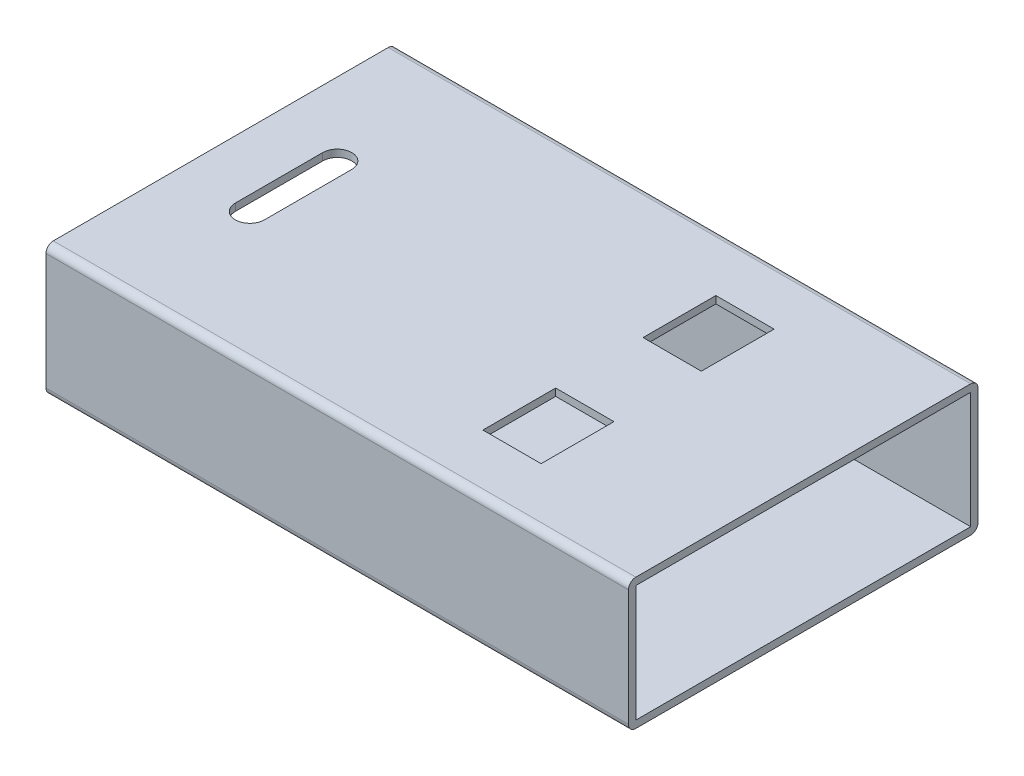
ISO-10303-21;
HEADER;
FILE_DESCRIPTION(('STEP AP214'),'2;1');
FILE_NAME('part.step','',(''),(''),'','','');
FILE_SCHEMA(('AUTOMOTIVE_DESIGN { 1 0 10303 214 1 1 1 1 }'));
ENDSEC;
DATA;
#1=APPLICATION_CONTEXT('core data for automotive mechanical design processes');
#2=APPLICATION_PROTOCOL_DEFINITION('international standard','automotive_design',2000,#1);
#3=PRODUCT_CONTEXT('',#1,'mechanical');
#4=PRODUCT('Part','Part','',(#3));
#5=PRODUCT_RELATED_PRODUCT_CATEGORY('part','',(#4));
#6=PRODUCT_DEFINITION_FORMATION('','',#4);
#7=PRODUCT_DEFINITION_CONTEXT('part definition',#1,'design');
#8=PRODUCT_DEFINITION('design','',#6,#7);
#9=PRODUCT_DEFINITION_SHAPE('','',#8);
#10=(LENGTH_UNIT() NAMED_UNIT(*) SI_UNIT(.MILLI.,.METRE.));
#11=(NAMED_UNIT(*) PLANE_ANGLE_UNIT() SI_UNIT($,.RADIAN.));
#12=(NAMED_UNIT(*) SI_UNIT($,.STERADIAN.) SOLID_ANGLE_UNIT());
#13=UNCERTAINTY_MEASURE_WITH_UNIT(LENGTH_MEASURE(1.E-05),#10,'distance_accuracy_value','');
#14=(GEOMETRIC_REPRESENTATION_CONTEXT(3) GLOBAL_UNCERTAINTY_ASSIGNED_CONTEXT((#13)) GLOBAL_UNIT_ASSIGNED_CONTEXT((#10,
#11,#12)) REPRESENTATION_CONTEXT('',''));
#15=CARTESIAN_POINT('',(0.,0.,0.));
#16=DIRECTION('',(0.,0.,1.));
#17=DIRECTION('',(1.,0.,0.));
#18=AXIS2_PLACEMENT_3D('',#15,#16,#17);
#19=CARTESIAN_POINT('',(-20.,2.,-5.75));
#20=DIRECTION('',(1.,0.,0.));
#21=DIRECTION('',(0.,0.,-1.));
#22=AXIS2_PLACEMENT_3D('',#19,#20,#21);
#23=CYLINDRICAL_SURFACE('',#22,0.25);
#24=CARTESIAN_POINT('',(0.,2.,-5.75));
#25=DIRECTION('',(1.,0.,0.));
#26=DIRECTION('',(0.,0.,1.));
#27=AXIS2_PLACEMENT_3D('',#24,#25,#26);
#28=CIRCLE('',#27,0.25);
#29=CARTESIAN_POINT('',(0.,2.,-6.));
#30=VERTEX_POINT('',#29);
#31=CARTESIAN_POINT('',(0.,2.25,-5.75));
#32=VERTEX_POINT('',#31);
#33=EDGE_CURVE('E489',#30,#32,#28,.T.);
#34=ORIENTED_EDGE('',*,*,#33,.F.);
#35=DIRECTION('',(1.,0.,0.));
#36=VECTOR('',#35,1.);
#37=CARTESIAN_POINT('',(-20.,2.,-6.));
#38=LINE('',#37,#36);
#39=CARTESIAN_POINT('',(-20.,2.,-6.));
#40=VERTEX_POINT('',#39);
#41=EDGE_CURVE('E544',#40,#30,#38,.T.);
#42=ORIENTED_EDGE('',*,*,#41,.F.);
#43=CARTESIAN_POINT('',(-20.,2.,-5.75));
#44=DIRECTION('',(1.,0.,0.));
#45=DIRECTION('',(0.,0.,1.));
#46=AXIS2_PLACEMENT_3D('',#43,#44,#45);
#47=CIRCLE('',#46,0.25);
#48=CARTESIAN_POINT('',(-20.,2.25,-5.75));
#49=VERTEX_POINT('',#48);
#50=EDGE_CURVE('E496',#40,#49,#47,.T.);
#51=ORIENTED_EDGE('',*,*,#50,.T.);
#52=DIRECTION('',(1.,0.,0.));
#53=VECTOR('',#52,1.);
#54=CARTESIAN_POINT('',(-20.,2.25,-5.75));
#55=LINE('',#54,#53);
#56=EDGE_CURVE('E521',#49,#32,#55,.T.);
#57=ORIENTED_EDGE('',*,*,#56,.T.);
#58=EDGE_LOOP('',(#34,#42,#51,#57));
#59=FACE_BOUND('',#58,.T.);
#60=ADVANCED_FACE('F74',(#59),#23,.T.);
#61=CARTESIAN_POINT('',(-20.,-2.,-6.));
#62=DIRECTION('',(0.,0.,-1.));
#63=DIRECTION('',(-1.,0.,0.));
#64=AXIS2_PLACEMENT_3D('',#61,#62,#63);
#65=PLANE('',#64);
#66=DIRECTION('',(0.,1.,0.));
#67=VECTOR('',#66,1.);
#68=CARTESIAN_POINT('',(0.,-2.,-6.));
#69=LINE('',#68,#67);
#70=CARTESIAN_POINT('',(0.,-2.,-6.));
#71=VERTEX_POINT('',#70);
#72=EDGE_CURVE('E500',#71,#30,#69,.T.);
#73=ORIENTED_EDGE('',*,*,#72,.F.);
#74=DIRECTION('',(1.,0.,0.));
#75=VECTOR('',#74,1.);
#76=CARTESIAN_POINT('',(-20.,-2.,-6.));
#77=LINE('',#76,#75);
#78=CARTESIAN_POINT('',(-20.,-2.,-6.));
#79=VERTEX_POINT('',#78);
#80=EDGE_CURVE('E547',#79,#71,#77,.T.);
#81=ORIENTED_EDGE('',*,*,#80,.F.);
#82=DIRECTION('',(0.,1.,0.));
#83=VECTOR('',#82,1.);
#84=CARTESIAN_POINT('',(-20.,-2.,-6.));
#85=LINE('',#84,#83);
#86=EDGE_CURVE('E518',#79,#40,#85,.T.);
#87=ORIENTED_EDGE('',*,*,#86,.T.);
#88=ORIENTED_EDGE('',*,*,#41,.T.);
#89=EDGE_LOOP('',(#73,#81,#87,#88));
#90=FACE_BOUND('',#89,.T.);
#91=ADVANCED_FACE('F619',(#90),#65,.T.);
#92=CARTESIAN_POINT('',(-20.,-2.,-5.75));
#93=DIRECTION('',(1.,0.,0.));
#94=DIRECTION('',(0.,0.,-1.));
#95=AXIS2_PLACEMENT_3D('',#92,#93,#94);
#96=CYLINDRICAL_SURFACE('',#95,0.25);
#97=CARTESIAN_POINT('',(0.,-2.,-5.75));
#98=DIRECTION('',(1.,0.,0.));
#99=DIRECTION('',(0.,0.,-1.));
#100=AXIS2_PLACEMENT_3D('',#97,#98,#99);
#101=CIRCLE('',#100,0.25);
#102=CARTESIAN_POINT('',(0.,-2.25,-5.75));
#103=VERTEX_POINT('',#102);
#104=EDGE_CURVE('E539',#103,#71,#101,.T.);
#105=ORIENTED_EDGE('',*,*,#104,.F.);
#106=DIRECTION('',(1.,0.,0.));
#107=VECTOR('',#106,1.);
#108=CARTESIAN_POINT('',(-20.,-2.25,-5.75));
#109=LINE('',#108,#107);
#110=CARTESIAN_POINT('',(-20.,-2.25,-5.75));
#111=VERTEX_POINT('',#110);
#112=EDGE_CURVE('E549',#111,#103,#109,.T.);
#113=ORIENTED_EDGE('',*,*,#112,.F.);
#114=CARTESIAN_POINT('',(-20.,-2.,-5.75));
#115=DIRECTION('',(1.,0.,0.));
#116=DIRECTION('',(0.,0.,-1.));
#117=AXIS2_PLACEMENT_3D('',#114,#115,#116);
#118=CIRCLE('',#117,0.25);
#119=EDGE_CURVE('E515',#111,#79,#118,.T.);
#120=ORIENTED_EDGE('',*,*,#119,.T.);
#121=ORIENTED_EDGE('',*,*,#80,.T.);
#122=EDGE_LOOP('',(#105,#113,#120,#121));
#123=FACE_BOUND('',#122,.T.);
#124=ADVANCED_FACE('F624',(#123),#96,.T.);
#125=CARTESIAN_POINT('',(-20.,-2.25,5.75));
#126=DIRECTION('',(0.,-1.,0.));
#127=DIRECTION('',(0.,0.,-1.));
#128=AXIS2_PLACEMENT_3D('',#125,#126,#127);
#129=PLANE('',#128);
#130=CARTESIAN_POINT('',(-17.5,-2.25,1.5));
#131=DIRECTION('',(0.,1.,0.));
#132=DIRECTION('',(0.,0.,1.));
#133=AXIS2_PLACEMENT_3D('',#130,#131,#132);
#134=CIRCLE('',#133,0.5);
#135=CARTESIAN_POINT('',(-18.,-2.25,1.5));
#136=VERTEX_POINT('',#135);
#137=CARTESIAN_POINT('',(-17.,-2.25,1.5));
#138=VERTEX_POINT('',#137);
#139=EDGE_CURVE('E313',#136,#138,#134,.T.);
#140=ORIENTED_EDGE('',*,*,#139,.T.);
#141=DIRECTION('',(0.,0.,-1.));
#142=VECTOR('',#141,1.);
#143=CARTESIAN_POINT('',(-17.,-2.25,1.5));
#144=LINE('',#143,#142);
#145=CARTESIAN_POINT('',(-17.,-2.25,-1.5));
#146=VERTEX_POINT('',#145);
#147=EDGE_CURVE('E323',#138,#146,#144,.T.);
#148=ORIENTED_EDGE('',*,*,#147,.T.);
#149=CARTESIAN_POINT('',(-17.5,-2.25,-1.5));
#150=DIRECTION('',(0.,1.,0.));
#151=DIRECTION('',(0.,0.,1.));
#152=AXIS2_PLACEMENT_3D('',#149,#150,#151);
#153=CIRCLE('',#152,0.5);
#154=CARTESIAN_POINT('',(-18.,-2.25,-1.5));
#155=VERTEX_POINT('',#154);
#156=EDGE_CURVE('E88',#146,#155,#153,.T.);
#157=ORIENTED_EDGE('',*,*,#156,.T.);
#158=DIRECTION('',(0.,0.,1.));
#159=VECTOR('',#158,1.);
#160=CARTESIAN_POINT('',(-18.,-2.25,1.5));
#161=LINE('',#160,#159);
#162=EDGE_CURVE('E331',#155,#136,#161,.T.);
#163=ORIENTED_EDGE('',*,*,#162,.T.);
#164=EDGE_LOOP('',(#140,#148,#157,#163));
#165=FACE_BOUND('',#164,.T.);
#166=DIRECTION('',(1.,0.,0.));
#167=VECTOR('',#166,1.);
#168=CARTESIAN_POINT('',(-7.,-2.25,-1.5));
#169=LINE('',#168,#167);
#170=CARTESIAN_POINT('',(-7.,-2.25,-1.5));
#171=VERTEX_POINT('',#170);
#172=CARTESIAN_POINT('',(-5.,-2.25,-1.5));
#173=VERTEX_POINT('',#172);
#174=EDGE_CURVE('E364',#171,#173,#169,.T.);
#175=ORIENTED_EDGE('',*,*,#174,.T.);
#176=DIRECTION('',(0.,0.,-1.));
#177=VECTOR('',#176,1.);
#178=CARTESIAN_POINT('',(-5.,-2.25,-1.5));
#179=LINE('',#178,#177);
#180=CARTESIAN_POINT('',(-5.,-2.25,-4.));
#181=VERTEX_POINT('',#180);
#182=EDGE_CURVE('E367',#173,#181,#179,.T.);
#183=ORIENTED_EDGE('',*,*,#182,.T.);
#184=DIRECTION('',(-1.,0.,0.));
#185=VECTOR('',#184,1.);
#186=CARTESIAN_POINT('',(-7.,-2.25,-4.));
#187=LINE('',#186,#185);
#188=CARTESIAN_POINT('',(-7.,-2.25,-4.));
#189=VERTEX_POINT('',#188);
#190=EDGE_CURVE('E371',#181,#189,#187,.T.);
#191=ORIENTED_EDGE('',*,*,#190,.T.);
#192=DIRECTION('',(0.,0.,1.));
#193=VECTOR('',#192,1.);
#194=CARTESIAN_POINT('',(-7.,-2.25,-1.5));
#195=LINE('',#194,#193);
#196=EDGE_CURVE('E374',#189,#171,#195,.T.);
#197=ORIENTED_EDGE('',*,*,#196,.T.);
#198=EDGE_LOOP('',(#175,#183,#191,#197));
#199=FACE_BOUND('',#198,.T.);
#200=DIRECTION('',(0.,0.,-1.));
#201=VECTOR('',#200,1.);
#202=CARTESIAN_POINT('',(-5.,-2.25,1.5));
#203=LINE('',#202,#201);
#204=CARTESIAN_POINT('',(-5.,-2.25,4.));
#205=VERTEX_POINT('',#204);
#206=CARTESIAN_POINT('',(-5.,-2.25,1.5));
#207=VERTEX_POINT('',#206);
#208=EDGE_CURVE('E414',#205,#207,#203,.T.);
#209=ORIENTED_EDGE('',*,*,#208,.T.);
#210=DIRECTION('',(-1.,0.,0.));
#211=VECTOR('',#210,1.);
#212=CARTESIAN_POINT('',(-7.,-2.25,1.5));
#213=LINE('',#212,#211);
#214=CARTESIAN_POINT('',(-7.,-2.25,1.5));
#215=VERTEX_POINT('',#214);
#216=EDGE_CURVE('E417',#207,#215,#213,.T.);
#217=ORIENTED_EDGE('',*,*,#216,.T.);
#218=DIRECTION('',(0.,0.,1.));
#219=VECTOR('',#218,1.);
#220=CARTESIAN_POINT('',(-7.,-2.25,1.5));
#221=LINE('',#220,#219);
#222=CARTESIAN_POINT('',(-7.,-2.25,4.));
#223=VERTEX_POINT('',#222);
#224=EDGE_CURVE('E421',#215,#223,#221,.T.);
#225=ORIENTED_EDGE('',*,*,#224,.T.);
#226=DIRECTION('',(1.,0.,0.));
#227=VECTOR('',#226,1.);
#228=CARTESIAN_POINT('',(-7.,-2.25,4.));
#229=LINE('',#228,#227);
#230=EDGE_CURVE('E424',#223,#205,#229,.T.);
#231=ORIENTED_EDGE('',*,*,#230,.T.);
#232=EDGE_LOOP('',(#209,#217,#225,#231));
#233=FACE_BOUND('',#232,.T.);
#234=DIRECTION('',(0.,0.,-1.));
#235=VECTOR('',#234,1.);
#236=CARTESIAN_POINT('',(0.,-2.25,5.75));
#237=LINE('',#236,#235);
#238=CARTESIAN_POINT('',(0.,-2.25,5.75));
#239=VERTEX_POINT('',#238);
#240=EDGE_CURVE('E536',#239,#103,#237,.T.);
#241=ORIENTED_EDGE('',*,*,#240,.F.);
#242=DIRECTION('',(1.,0.,0.));
#243=VECTOR('',#242,1.);
#244=CARTESIAN_POINT('',(-20.,-2.25,5.75));
#245=LINE('',#244,#243);
#246=CARTESIAN_POINT('',(-20.,-2.25,5.75));
#247=VERTEX_POINT('',#246);
#248=EDGE_CURVE('E551',#247,#239,#245,.T.);
#249=ORIENTED_EDGE('',*,*,#248,.F.);
#250=DIRECTION('',(0.,0.,-1.));
#251=VECTOR('',#250,1.);
#252=CARTESIAN_POINT('',(-20.,-2.25,5.75));
#253=LINE('',#252,#251);
#254=EDGE_CURVE('E512',#247,#111,#253,.T.);
#255=ORIENTED_EDGE('',*,*,#254,.T.);
#256=ORIENTED_EDGE('',*,*,#112,.T.);
#257=EDGE_LOOP('',(#241,#249,#255,#256));
#258=FACE_BOUND('',#257,.T.);
#259=ADVANCED_FACE('F328',(#165,#199,#233,#258),#129,.T.);
#260=CARTESIAN_POINT('',(-20.,-2.,5.75));
#261=DIRECTION('',(1.,0.,0.));
#262=DIRECTION('',(0.,0.,-1.));
#263=AXIS2_PLACEMENT_3D('',#260,#261,#262);
#264=CYLINDRICAL_SURFACE('',#263,0.25);
#265=CARTESIAN_POINT('',(0.,-2.,5.75));
#266=DIRECTION('',(1.,0.,0.));
#267=DIRECTION('',(0.,0.,1.));
#268=AXIS2_PLACEMENT_3D('',#265,#266,#267);
#269=CIRCLE('',#268,0.25);
#270=CARTESIAN_POINT('',(0.,-2.,6.));
#271=VERTEX_POINT('',#270);
#272=EDGE_CURVE('E533',#271,#239,#269,.T.);
#273=ORIENTED_EDGE('',*,*,#272,.F.);
#274=DIRECTION('',(1.,0.,0.));
#275=VECTOR('',#274,1.);
#276=CARTESIAN_POINT('',(-20.,-2.,6.));
#277=LINE('',#276,#275);
#278=CARTESIAN_POINT('',(-20.,-2.,6.));
#279=VERTEX_POINT('',#278);
#280=EDGE_CURVE('E553',#279,#271,#277,.T.);
#281=ORIENTED_EDGE('',*,*,#280,.F.);
#282=CARTESIAN_POINT('',(-20.,-2.,5.75));
#283=DIRECTION('',(1.,0.,0.));
#284=DIRECTION('',(0.,0.,1.));
#285=AXIS2_PLACEMENT_3D('',#282,#283,#284);
#286=CIRCLE('',#285,0.25);
#287=EDGE_CURVE('E509',#279,#247,#286,.T.);
#288=ORIENTED_EDGE('',*,*,#287,.T.);
#289=ORIENTED_EDGE('',*,*,#248,.T.);
#290=EDGE_LOOP('',(#273,#281,#288,#289));
#291=FACE_BOUND('',#290,.T.);
#292=ADVANCED_FACE('F652',(#291),#264,.T.);
#293=CARTESIAN_POINT('',(-20.,-2.,6.));
#294=DIRECTION('',(0.,0.,1.));
#295=DIRECTION('',(1.,0.,0.));
#296=AXIS2_PLACEMENT_3D('',#293,#294,#295);
#297=PLANE('',#296);
#298=DIRECTION('',(0.,-1.,0.));
#299=VECTOR('',#298,1.);
#300=CARTESIAN_POINT('',(0.,-2.,6.));
#301=LINE('',#300,#299);
#302=CARTESIAN_POINT('',(0.,2.,6.));
#303=VERTEX_POINT('',#302);
#304=EDGE_CURVE('E530',#303,#271,#301,.T.);
#305=ORIENTED_EDGE('',*,*,#304,.F.);
#306=DIRECTION('',(1.,0.,0.));
#307=VECTOR('',#306,1.);
#308=CARTESIAN_POINT('',(-20.,2.,6.));
#309=LINE('',#308,#307);
#310=CARTESIAN_POINT('',(-20.,2.,6.));
#311=VERTEX_POINT('',#310);
#312=EDGE_CURVE('E555',#311,#303,#309,.T.);
#313=ORIENTED_EDGE('',*,*,#312,.F.);
#314=DIRECTION('',(0.,-1.,0.));
#315=VECTOR('',#314,1.);
#316=CARTESIAN_POINT('',(-20.,-2.,6.));
#317=LINE('',#316,#315);
#318=EDGE_CURVE('E506',#311,#279,#317,.T.);
#319=ORIENTED_EDGE('',*,*,#318,.T.);
#320=ORIENTED_EDGE('',*,*,#280,.T.);
#321=EDGE_LOOP('',(#305,#313,#319,#320));
#322=FACE_BOUND('',#321,.T.);
#323=ADVANCED_FACE('F648',(#322),#297,.T.);
#324=CARTESIAN_POINT('',(-20.,2.,5.75));
#325=DIRECTION('',(1.,0.,0.));
#326=DIRECTION('',(0.,0.,-1.));
#327=AXIS2_PLACEMENT_3D('',#324,#325,#326);
#328=CYLINDRICAL_SURFACE('',#327,0.25);
#329=CARTESIAN_POINT('',(0.,2.,5.75));
#330=DIRECTION('',(1.,0.,0.));
#331=DIRECTION('',(0.,0.,1.));
#332=AXIS2_PLACEMENT_3D('',#329,#330,#331);
#333=CIRCLE('',#332,0.25);
#334=CARTESIAN_POINT('',(0.,2.25,5.75));
#335=VERTEX_POINT('',#334);
#336=EDGE_CURVE('E527',#335,#303,#333,.T.);
#337=ORIENTED_EDGE('',*,*,#336,.F.);
#338=DIRECTION('',(1.,0.,0.));
#339=VECTOR('',#338,1.);
#340=CARTESIAN_POINT('',(-20.,2.25,5.75));
#341=LINE('',#340,#339);
#342=CARTESIAN_POINT('',(-20.,2.25,5.75));
#343=VERTEX_POINT('',#342);
#344=EDGE_CURVE('E557',#343,#335,#341,.T.);
#345=ORIENTED_EDGE('',*,*,#344,.F.);
#346=CARTESIAN_POINT('',(-20.,2.,5.75));
#347=DIRECTION('',(1.,0.,0.));
#348=DIRECTION('',(0.,0.,1.));
#349=AXIS2_PLACEMENT_3D('',#346,#347,#348);
#350=CIRCLE('',#349,0.25);
#351=EDGE_CURVE('E503',#343,#311,#350,.T.);
#352=ORIENTED_EDGE('',*,*,#351,.T.);
#353=ORIENTED_EDGE('',*,*,#312,.T.);
#354=EDGE_LOOP('',(#337,#345,#352,#353));
#355=FACE_BOUND('',#354,.T.);
#356=ADVANCED_FACE('F646',(#355),#328,.T.);
#357=CARTESIAN_POINT('',(-20.,2.25,5.75));
#358=DIRECTION('',(0.,1.,0.));
#359=DIRECTION('',(0.,0.,1.));
#360=AXIS2_PLACEMENT_3D('',#357,#358,#359);
#361=PLANE('',#360);
#362=CARTESIAN_POINT('',(-17.5,2.25,1.5));
#363=DIRECTION('',(0.,1.,0.));
#364=DIRECTION('',(0.,0.,1.));
#365=AXIS2_PLACEMENT_3D('',#362,#363,#364);
#366=CIRCLE('',#365,0.5);
#367=CARTESIAN_POINT('',(-18.,2.25,1.5));
#368=VERTEX_POINT('',#367);
#369=CARTESIAN_POINT('',(-17.,2.25,1.5));
#370=VERTEX_POINT('',#369);
#371=EDGE_CURVE('E96',#368,#370,#366,.T.);
#372=ORIENTED_EDGE('',*,*,#371,.F.);
#373=DIRECTION('',(0.,0.,1.));
#374=VECTOR('',#373,1.);
#375=CARTESIAN_POINT('',(-18.,2.25,1.5));
#376=LINE('',#375,#374);
#377=CARTESIAN_POINT('',(-18.,2.25,-1.5));
#378=VERTEX_POINT('',#377);
#379=EDGE_CURVE('E332',#378,#368,#376,.T.);
#380=ORIENTED_EDGE('',*,*,#379,.F.);
#381=CARTESIAN_POINT('',(-17.5,2.25,-1.5));
#382=DIRECTION('',(0.,1.,0.));
#383=DIRECTION('',(0.,0.,1.));
#384=AXIS2_PLACEMENT_3D('',#381,#382,#383);
#385=CIRCLE('',#384,0.5);
#386=CARTESIAN_POINT('',(-17.,2.25,-1.5));
#387=VERTEX_POINT('',#386);
#388=EDGE_CURVE('E335',#387,#378,#385,.T.);
#389=ORIENTED_EDGE('',*,*,#388,.F.);
#390=DIRECTION('',(0.,0.,-1.));
#391=VECTOR('',#390,1.);
#392=CARTESIAN_POINT('',(-17.,2.25,1.5));
#393=LINE('',#392,#391);
#394=EDGE_CURVE('E341',#370,#387,#393,.T.);
#395=ORIENTED_EDGE('',*,*,#394,.F.);
#396=EDGE_LOOP('',(#372,#380,#389,#395));
#397=FACE_BOUND('',#396,.T.);
#398=DIRECTION('',(1.,0.,0.));
#399=VECTOR('',#398,1.);
#400=CARTESIAN_POINT('',(-7.,2.25,-1.5));
#401=LINE('',#400,#399);
#402=CARTESIAN_POINT('',(-7.,2.25,-1.5));
#403=VERTEX_POINT('',#402);
#404=CARTESIAN_POINT('',(-5.,2.25,-1.5));
#405=VERTEX_POINT('',#404);
#406=EDGE_CURVE('E363',#403,#405,#401,.T.);
#407=ORIENTED_EDGE('',*,*,#406,.F.);
#408=DIRECTION('',(0.,0.,1.));
#409=VECTOR('',#408,1.);
#410=CARTESIAN_POINT('',(-7.,2.25,-1.5));
#411=LINE('',#410,#409);
#412=CARTESIAN_POINT('',(-7.,2.25,-4.));
#413=VERTEX_POINT('',#412);
#414=EDGE_CURVE('E368',#413,#403,#411,.T.);
#415=ORIENTED_EDGE('',*,*,#414,.F.);
#416=DIRECTION('',(-1.,0.,0.));
#417=VECTOR('',#416,1.);
#418=CARTESIAN_POINT('',(-7.,2.25,-4.));
#419=LINE('',#418,#417);
#420=CARTESIAN_POINT('',(-5.,2.25,-4.));
#421=VERTEX_POINT('',#420);
#422=EDGE_CURVE('E382',#421,#413,#419,.T.);
#423=ORIENTED_EDGE('',*,*,#422,.F.);
#424=DIRECTION('',(0.,0.,-1.));
#425=VECTOR('',#424,1.);
#426=CARTESIAN_POINT('',(-5.,2.25,-1.5));
#427=LINE('',#426,#425);
#428=EDGE_CURVE('E379',#405,#421,#427,.T.);
#429=ORIENTED_EDGE('',*,*,#428,.F.);
#430=EDGE_LOOP('',(#407,#415,#423,#429));
#431=FACE_BOUND('',#430,.T.);
#432=DIRECTION('',(0.,0.,-1.));
#433=VECTOR('',#432,1.);
#434=CARTESIAN_POINT('',(-5.,2.25,1.5));
#435=LINE('',#434,#433);
#436=CARTESIAN_POINT('',(-5.,2.25,4.));
#437=VERTEX_POINT('',#436);
#438=CARTESIAN_POINT('',(-5.,2.25,1.5));
#439=VERTEX_POINT('',#438);
#440=EDGE_CURVE('E413',#437,#439,#435,.T.);
#441=ORIENTED_EDGE('',*,*,#440,.F.);
#442=DIRECTION('',(1.,0.,0.));
#443=VECTOR('',#442,1.);
#444=CARTESIAN_POINT('',(-7.,2.25,4.));
#445=LINE('',#444,#443);
#446=CARTESIAN_POINT('',(-7.,2.25,4.));
#447=VERTEX_POINT('',#446);
#448=EDGE_CURVE('E418',#447,#437,#445,.T.);
#449=ORIENTED_EDGE('',*,*,#448,.F.);
#450=DIRECTION('',(0.,0.,1.));
#451=VECTOR('',#450,1.);
#452=CARTESIAN_POINT('',(-7.,2.25,1.5));
#453=LINE('',#452,#451);
#454=CARTESIAN_POINT('',(-7.,2.25,1.5));
#455=VERTEX_POINT('',#454);
#456=EDGE_CURVE('E432',#455,#447,#453,.T.);
#457=ORIENTED_EDGE('',*,*,#456,.F.);
#458=DIRECTION('',(-1.,0.,0.));
#459=VECTOR('',#458,1.);
#460=CARTESIAN_POINT('',(-7.,2.25,1.5));
#461=LINE('',#460,#459);
#462=EDGE_CURVE('E429',#439,#455,#461,.T.);
#463=ORIENTED_EDGE('',*,*,#462,.F.);
#464=EDGE_LOOP('',(#441,#449,#457,#463));
#465=FACE_BOUND('',#464,.T.);
#466=DIRECTION('',(0.,0.,1.));
#467=VECTOR('',#466,1.);
#468=CARTESIAN_POINT('',(0.,2.25,5.75));
#469=LINE('',#468,#467);
#470=EDGE_CURVE('E524',#32,#335,#469,.T.);
#471=ORIENTED_EDGE('',*,*,#470,.F.);
#472=ORIENTED_EDGE('',*,*,#56,.F.);
#473=DIRECTION('',(0.,0.,1.));
#474=VECTOR('',#473,1.);
#475=CARTESIAN_POINT('',(-20.,2.25,5.75));
#476=LINE('',#475,#474);
#477=EDGE_CURVE('E499',#49,#343,#476,.T.);
#478=ORIENTED_EDGE('',*,*,#477,.T.);
#479=ORIENTED_EDGE('',*,*,#344,.T.);
#480=EDGE_LOOP('',(#471,#472,#478,#479));
#481=FACE_BOUND('',#480,.T.);
#482=ADVANCED_FACE('F603',(#397,#431,#465,#481),#361,.T.);
#483=CARTESIAN_POINT('',(-20.,2.,-5.75));
#484=DIRECTION('',(1.,0.,0.));
#485=DIRECTION('',(0.,0.,-1.));
#486=AXIS2_PLACEMENT_3D('',#483,#484,#485);
#487=PLANE('',#486);
#488=DIRECTION('',(0.,0.,-1.));
#489=VECTOR('',#488,1.);
#490=CARTESIAN_POINT('',(-20.,-2.,-5.75));
#491=LINE('',#490,#489);
#492=CARTESIAN_POINT('',(-20.,-2.,5.75));
#493=VERTEX_POINT('',#492);
#494=CARTESIAN_POINT('',(-20.,-2.,-5.75));
#495=VERTEX_POINT('',#494);
#496=EDGE_CURVE('E474',#493,#495,#491,.T.);
#497=ORIENTED_EDGE('',*,*,#496,.T.);
#498=DIRECTION('',(0.,1.,0.));
#499=VECTOR('',#498,1.);
#500=CARTESIAN_POINT('',(-20.,2.,-5.75));
#501=LINE('',#500,#499);
#502=CARTESIAN_POINT('',(-20.,2.,-5.75));
#503=VERTEX_POINT('',#502);
#504=EDGE_CURVE('E464',#495,#503,#501,.T.);
#505=ORIENTED_EDGE('',*,*,#504,.T.);
#506=DIRECTION('',(0.,0.,1.));
#507=VECTOR('',#506,1.);
#508=CARTESIAN_POINT('',(-20.,2.,-5.75));
#509=LINE('',#508,#507);
#510=CARTESIAN_POINT('',(-20.,2.,5.75));
#511=VERTEX_POINT('',#510);
#512=EDGE_CURVE('E467',#503,#511,#509,.T.);
#513=ORIENTED_EDGE('',*,*,#512,.T.);
#514=DIRECTION('',(0.,-1.,0.));
#515=VECTOR('',#514,1.);
#516=CARTESIAN_POINT('',(-20.,2.,5.75));
#517=LINE('',#516,#515);
#518=EDGE_CURVE('E471',#511,#493,#517,.T.);
#519=ORIENTED_EDGE('',*,*,#518,.T.);
#520=EDGE_LOOP('',(#497,#505,#513,#519));
#521=FACE_BOUND('',#520,.T.);
#522=ORIENTED_EDGE('',*,*,#50,.F.);
#523=ORIENTED_EDGE('',*,*,#86,.F.);
#524=ORIENTED_EDGE('',*,*,#119,.F.);
#525=ORIENTED_EDGE('',*,*,#254,.F.);
#526=ORIENTED_EDGE('',*,*,#287,.F.);
#527=ORIENTED_EDGE('',*,*,#318,.F.);
#528=ORIENTED_EDGE('',*,*,#351,.F.);
#529=ORIENTED_EDGE('',*,*,#477,.F.);
#530=EDGE_LOOP('',(#522,#523,#524,#525,#526,#527,#528,#529));
#531=FACE_BOUND('',#530,.T.);
#532=ADVANCED_FACE('F637',(#521,#531),#487,.F.);
#533=CARTESIAN_POINT('',(0.,2.,-5.75));
#534=DIRECTION('',(1.,0.,0.));
#535=DIRECTION('',(0.,0.,-1.));
#536=AXIS2_PLACEMENT_3D('',#533,#534,#535);
#537=PLANE('',#536);
#538=DIRECTION('',(0.,1.,0.));
#539=VECTOR('',#538,1.);
#540=CARTESIAN_POINT('',(0.,2.,-5.75));
#541=LINE('',#540,#539);
#542=CARTESIAN_POINT('',(0.,-2.,-5.75));
#543=VERTEX_POINT('',#542);
#544=CARTESIAN_POINT('',(0.,2.,-5.75));
#545=VERTEX_POINT('',#544);
#546=EDGE_CURVE('E463',#543,#545,#541,.T.);
#547=ORIENTED_EDGE('',*,*,#546,.F.);
#548=DIRECTION('',(0.,0.,-1.));
#549=VECTOR('',#548,1.);
#550=CARTESIAN_POINT('',(0.,-2.,-5.75));
#551=LINE('',#550,#549);
#552=CARTESIAN_POINT('',(0.,-2.,5.75));
#553=VERTEX_POINT('',#552);
#554=EDGE_CURVE('E468',#553,#543,#551,.T.);
#555=ORIENTED_EDGE('',*,*,#554,.F.);
#556=DIRECTION('',(0.,-1.,0.));
#557=VECTOR('',#556,1.);
#558=CARTESIAN_POINT('',(0.,2.,5.75));
#559=LINE('',#558,#557);
#560=CARTESIAN_POINT('',(0.,2.,5.75));
#561=VERTEX_POINT('',#560);
#562=EDGE_CURVE('E482',#561,#553,#559,.T.);
#563=ORIENTED_EDGE('',*,*,#562,.F.);
#564=DIRECTION('',(0.,0.,1.));
#565=VECTOR('',#564,1.);
#566=CARTESIAN_POINT('',(0.,2.,-5.75));
#567=LINE('',#566,#565);
#568=EDGE_CURVE('E479',#545,#561,#567,.T.);
#569=ORIENTED_EDGE('',*,*,#568,.F.);
#570=EDGE_LOOP('',(#547,#555,#563,#569));
#571=FACE_BOUND('',#570,.T.);
#572=ORIENTED_EDGE('',*,*,#33,.T.);
#573=ORIENTED_EDGE('',*,*,#470,.T.);
#574=ORIENTED_EDGE('',*,*,#336,.T.);
#575=ORIENTED_EDGE('',*,*,#304,.T.);
#576=ORIENTED_EDGE('',*,*,#272,.T.);
#577=ORIENTED_EDGE('',*,*,#240,.T.);
#578=ORIENTED_EDGE('',*,*,#104,.T.);
#579=ORIENTED_EDGE('',*,*,#72,.T.);
#580=EDGE_LOOP('',(#572,#573,#574,#575,#576,#577,#578,#579));
#581=FACE_BOUND('',#580,.T.);
#582=ADVANCED_FACE('F632',(#571,#581),#537,.T.);
#583=CARTESIAN_POINT('',(-20.,2.,-5.75));
#584=DIRECTION('',(0.,0.,-1.));
#585=DIRECTION('',(-1.,0.,0.));
#586=AXIS2_PLACEMENT_3D('',#583,#584,#585);
#587=PLANE('',#586);
#588=ORIENTED_EDGE('',*,*,#546,.T.);
#589=DIRECTION('',(1.,0.,0.));
#590=VECTOR('',#589,1.);
#591=CARTESIAN_POINT('',(-20.,2.,-5.75));
#592=LINE('',#591,#590);
#593=EDGE_CURVE('E477',#503,#545,#592,.T.);
#594=ORIENTED_EDGE('',*,*,#593,.F.);
#595=ORIENTED_EDGE('',*,*,#504,.F.);
#596=DIRECTION('',(1.,0.,0.));
#597=VECTOR('',#596,1.);
#598=CARTESIAN_POINT('',(-20.,-2.,-5.75));
#599=LINE('',#598,#597);
#600=EDGE_CURVE('E487',#495,#543,#599,.T.);
#601=ORIENTED_EDGE('',*,*,#600,.T.);
#602=EDGE_LOOP('',(#588,#594,#595,#601));
#603=FACE_BOUND('',#602,.T.);
#604=ADVANCED_FACE('F678',(#603),#587,.F.);
#605=CARTESIAN_POINT('',(-20.,-2.,-5.75));
#606=DIRECTION('',(0.,-1.,0.));
#607=DIRECTION('',(0.,0.,-1.));
#608=AXIS2_PLACEMENT_3D('',#605,#606,#607);
#609=PLANE('',#608);
#610=DIRECTION('',(0.,0.,1.));
#611=VECTOR('',#610,1.);
#612=CARTESIAN_POINT('',(-17.,-2.,-5.75));
#613=LINE('',#612,#611);
#614=CARTESIAN_POINT('',(-17.,-2.,-1.5));
#615=VERTEX_POINT('',#614);
#616=CARTESIAN_POINT('',(-17.,-2.,1.5));
#617=VERTEX_POINT('',#616);
#618=EDGE_CURVE('E348',#615,#617,#613,.T.);
#619=ORIENTED_EDGE('',*,*,#618,.T.);
#620=CARTESIAN_POINT('',(-17.5,-2.,1.5));
#621=DIRECTION('',(0.,-1.,0.));
#622=DIRECTION('',(0.,0.,-1.));
#623=AXIS2_PLACEMENT_3D('',#620,#621,#622);
#624=CIRCLE('',#623,0.5);
#625=CARTESIAN_POINT('',(-18.,-2.,1.5));
#626=VERTEX_POINT('',#625);
#627=EDGE_CURVE('E316',#617,#626,#624,.T.);
#628=ORIENTED_EDGE('',*,*,#627,.T.);
#629=DIRECTION('',(0.,0.,-1.));
#630=VECTOR('',#629,1.);
#631=CARTESIAN_POINT('',(-18.,-2.,-5.75));
#632=LINE('',#631,#630);
#633=CARTESIAN_POINT('',(-18.,-2.,-1.5));
#634=VERTEX_POINT('',#633);
#635=EDGE_CURVE('E359',#626,#634,#632,.T.);
#636=ORIENTED_EDGE('',*,*,#635,.T.);
#637=CARTESIAN_POINT('',(-17.5,-2.,-1.5));
#638=DIRECTION('',(0.,-1.,0.));
#639=DIRECTION('',(0.,0.,-1.));
#640=AXIS2_PLACEMENT_3D('',#637,#638,#639);
#641=CIRCLE('',#640,0.5);
#642=EDGE_CURVE('E356',#634,#615,#641,.T.);
#643=ORIENTED_EDGE('',*,*,#642,.T.);
#644=EDGE_LOOP('',(#619,#628,#636,#643));
#645=FACE_BOUND('',#644,.T.);
#646=DIRECTION('',(0.,0.,1.));
#647=VECTOR('',#646,1.);
#648=CARTESIAN_POINT('',(-5.,-2.,-5.75));
#649=LINE('',#648,#647);
#650=CARTESIAN_POINT('',(-5.,-2.,-4.));
#651=VERTEX_POINT('',#650);
#652=CARTESIAN_POINT('',(-5.,-2.,-1.5));
#653=VERTEX_POINT('',#652);
#654=EDGE_CURVE('E390',#651,#653,#649,.T.);
#655=ORIENTED_EDGE('',*,*,#654,.T.);
#656=DIRECTION('',(-1.,0.,0.));
#657=VECTOR('',#656,1.);
#658=CARTESIAN_POINT('',(-20.,-2.,-1.5));
#659=LINE('',#658,#657);
#660=CARTESIAN_POINT('',(-7.,-2.,-1.5));
#661=VERTEX_POINT('',#660);
#662=EDGE_CURVE('E410',#653,#661,#659,.T.);
#663=ORIENTED_EDGE('',*,*,#662,.T.);
#664=DIRECTION('',(0.,0.,-1.));
#665=VECTOR('',#664,1.);
#666=CARTESIAN_POINT('',(-7.,-2.,-5.75));
#667=LINE('',#666,#665);
#668=CARTESIAN_POINT('',(-7.,-2.,-4.));
#669=VERTEX_POINT('',#668);
#670=EDGE_CURVE('E407',#661,#669,#667,.T.);
#671=ORIENTED_EDGE('',*,*,#670,.T.);
#672=DIRECTION('',(1.,0.,0.));
#673=VECTOR('',#672,1.);
#674=CARTESIAN_POINT('',(-20.,-2.,-3.99999999999999));
#675=LINE('',#674,#673);
#676=EDGE_CURVE('E404',#669,#651,#675,.T.);
#677=ORIENTED_EDGE('',*,*,#676,.T.);
#678=EDGE_LOOP('',(#655,#663,#671,#677));
#679=FACE_BOUND('',#678,.T.);
#680=DIRECTION('',(1.,0.,0.));
#681=VECTOR('',#680,1.);
#682=CARTESIAN_POINT('',(-20.,-2.,1.5));
#683=LINE('',#682,#681);
#684=CARTESIAN_POINT('',(-7.,-2.,1.5));
#685=VERTEX_POINT('',#684);
#686=CARTESIAN_POINT('',(-5.,-2.,1.5));
#687=VERTEX_POINT('',#686);
#688=EDGE_CURVE('E440',#685,#687,#683,.T.);
#689=ORIENTED_EDGE('',*,*,#688,.T.);
#690=DIRECTION('',(0.,0.,1.));
#691=VECTOR('',#690,1.);
#692=CARTESIAN_POINT('',(-5.,-2.,-5.75000000000001));
#693=LINE('',#692,#691);
#694=CARTESIAN_POINT('',(-5.,-2.,4.));
#695=VERTEX_POINT('',#694);
#696=EDGE_CURVE('E460',#687,#695,#693,.T.);
#697=ORIENTED_EDGE('',*,*,#696,.T.);
#698=DIRECTION('',(-1.,0.,0.));
#699=VECTOR('',#698,1.);
#700=CARTESIAN_POINT('',(-20.,-2.,3.99999999999999));
#701=LINE('',#700,#699);
#702=CARTESIAN_POINT('',(-7.,-2.,4.));
#703=VERTEX_POINT('',#702);
#704=EDGE_CURVE('E457',#695,#703,#701,.T.);
#705=ORIENTED_EDGE('',*,*,#704,.T.);
#706=DIRECTION('',(0.,0.,-1.));
#707=VECTOR('',#706,1.);
#708=CARTESIAN_POINT('',(-7.,-2.,-5.75));
#709=LINE('',#708,#707);
#710=EDGE_CURVE('E454',#703,#685,#709,.T.);
#711=ORIENTED_EDGE('',*,*,#710,.T.);
#712=EDGE_LOOP('',(#689,#697,#705,#711));
#713=FACE_BOUND('',#712,.T.);
#714=ORIENTED_EDGE('',*,*,#554,.T.);
#715=ORIENTED_EDGE('',*,*,#600,.F.);
#716=ORIENTED_EDGE('',*,*,#496,.F.);
#717=DIRECTION('',(1.,0.,0.));
#718=VECTOR('',#717,1.);
#719=CARTESIAN_POINT('',(-20.,-2.,5.75));
#720=LINE('',#719,#718);
#721=EDGE_CURVE('E490',#493,#553,#720,.T.);
#722=ORIENTED_EDGE('',*,*,#721,.T.);
#723=EDGE_LOOP('',(#714,#715,#716,#722));
#724=FACE_BOUND('',#723,.T.);
#725=ADVANCED_FACE('F683',(#645,#679,#713,#724),#609,.F.);
#726=CARTESIAN_POINT('',(-20.,2.,5.75));
#727=DIRECTION('',(0.,0.,1.));
#728=DIRECTION('',(1.,0.,0.));
#729=AXIS2_PLACEMENT_3D('',#726,#727,#728);
#730=PLANE('',#729);
#731=ORIENTED_EDGE('',*,*,#562,.T.);
#732=ORIENTED_EDGE('',*,*,#721,.F.);
#733=ORIENTED_EDGE('',*,*,#518,.F.);
#734=DIRECTION('',(1.,0.,0.));
#735=VECTOR('',#734,1.);
#736=CARTESIAN_POINT('',(-20.,2.,5.75));
#737=LINE('',#736,#735);
#738=EDGE_CURVE('E492',#511,#561,#737,.T.);
#739=ORIENTED_EDGE('',*,*,#738,.T.);
#740=EDGE_LOOP('',(#731,#732,#733,#739));
#741=FACE_BOUND('',#740,.T.);
#742=ADVANCED_FACE('F688',(#741),#730,.F.);
#743=CARTESIAN_POINT('',(-20.,2.,-5.75));
#744=DIRECTION('',(0.,1.,0.));
#745=DIRECTION('',(0.,0.,1.));
#746=AXIS2_PLACEMENT_3D('',#743,#744,#745);
#747=PLANE('',#746);
#748=DIRECTION('',(0.,0.,1.));
#749=VECTOR('',#748,1.);
#750=CARTESIAN_POINT('',(-18.,2.,-5.75));
#751=LINE('',#750,#749);
#752=CARTESIAN_POINT('',(-18.,2.,-1.5));
#753=VERTEX_POINT('',#752);
#754=CARTESIAN_POINT('',(-18.,2.,1.5));
#755=VERTEX_POINT('',#754);
#756=EDGE_CURVE('E81',#753,#755,#751,.T.);
#757=ORIENTED_EDGE('',*,*,#756,.T.);
#758=CARTESIAN_POINT('',(-17.5,2.,1.5));
#759=DIRECTION('',(0.,1.,0.));
#760=DIRECTION('',(0.,0.,1.));
#761=AXIS2_PLACEMENT_3D('',#758,#759,#760);
#762=CIRCLE('',#761,0.5);
#763=CARTESIAN_POINT('',(-17.,2.,1.5));
#764=VERTEX_POINT('',#763);
#765=EDGE_CURVE('E12',#755,#764,#762,.T.);
#766=ORIENTED_EDGE('',*,*,#765,.T.);
#767=DIRECTION('',(0.,0.,-1.));
#768=VECTOR('',#767,1.);
#769=CARTESIAN_POINT('',(-17.,2.,-5.75));
#770=LINE('',#769,#768);
#771=CARTESIAN_POINT('',(-17.,2.,-1.5));
#772=VERTEX_POINT('',#771);
#773=EDGE_CURVE('E583',#764,#772,#770,.T.);
#774=ORIENTED_EDGE('',*,*,#773,.T.);
#775=CARTESIAN_POINT('',(-17.5,2.,-1.5));
#776=DIRECTION('',(0.,1.,0.));
#777=DIRECTION('',(0.,0.,1.));
#778=AXIS2_PLACEMENT_3D('',#775,#776,#777);
#779=CIRCLE('',#778,0.5);
#780=EDGE_CURVE('E586',#772,#753,#779,.T.);
#781=ORIENTED_EDGE('',*,*,#780,.T.);
#782=EDGE_LOOP('',(#757,#766,#774,#781));
#783=FACE_BOUND('',#782,.T.);
#784=DIRECTION('',(0.,0.,1.));
#785=VECTOR('',#784,1.);
#786=CARTESIAN_POINT('',(-7.,2.,-5.75));
#787=LINE('',#786,#785);
#788=CARTESIAN_POINT('',(-7.,2.,-4.));
#789=VERTEX_POINT('',#788);
#790=CARTESIAN_POINT('',(-7.,2.,-1.5));
#791=VERTEX_POINT('',#790);
#792=EDGE_CURVE('E577',#789,#791,#787,.T.);
#793=ORIENTED_EDGE('',*,*,#792,.T.);
#794=DIRECTION('',(1.,0.,0.));
#795=VECTOR('',#794,1.);
#796=CARTESIAN_POINT('',(-20.,2.,-1.5));
#797=LINE('',#796,#795);
#798=CARTESIAN_POINT('',(-5.,2.,-1.5));
#799=VERTEX_POINT('',#798);
#800=EDGE_CURVE('E580',#791,#799,#797,.T.);
#801=ORIENTED_EDGE('',*,*,#800,.T.);
#802=DIRECTION('',(0.,0.,-1.));
#803=VECTOR('',#802,1.);
#804=CARTESIAN_POINT('',(-5.,2.,-5.75));
#805=LINE('',#804,#803);
#806=CARTESIAN_POINT('',(-5.,2.,-4.));
#807=VERTEX_POINT('',#806);
#808=EDGE_CURVE('E571',#799,#807,#805,.T.);
#809=ORIENTED_EDGE('',*,*,#808,.T.);
#810=DIRECTION('',(-1.,0.,0.));
#811=VECTOR('',#810,1.);
#812=CARTESIAN_POINT('',(-20.,2.,-3.99999999999999));
#813=LINE('',#812,#811);
#814=EDGE_CURVE('E574',#807,#789,#813,.T.);
#815=ORIENTED_EDGE('',*,*,#814,.T.);
#816=EDGE_LOOP('',(#793,#801,#809,#815));
#817=FACE_BOUND('',#816,.T.);
#818=DIRECTION('',(1.,0.,0.));
#819=VECTOR('',#818,1.);
#820=CARTESIAN_POINT('',(-20.,2.,3.99999999999999));
#821=LINE('',#820,#819);
#822=CARTESIAN_POINT('',(-7.,2.,4.));
#823=VERTEX_POINT('',#822);
#824=CARTESIAN_POINT('',(-5.,2.,4.));
#825=VERTEX_POINT('',#824);
#826=EDGE_CURVE('E565',#823,#825,#821,.T.);
#827=ORIENTED_EDGE('',*,*,#826,.T.);
#828=DIRECTION('',(0.,0.,-1.));
#829=VECTOR('',#828,1.);
#830=CARTESIAN_POINT('',(-5.,2.,-5.75000000000001));
#831=LINE('',#830,#829);
#832=CARTESIAN_POINT('',(-5.,2.,1.5));
#833=VERTEX_POINT('',#832);
#834=EDGE_CURVE('E568',#825,#833,#831,.T.);
#835=ORIENTED_EDGE('',*,*,#834,.T.);
#836=DIRECTION('',(-1.,0.,0.));
#837=VECTOR('',#836,1.);
#838=CARTESIAN_POINT('',(-20.,2.,1.5));
#839=LINE('',#838,#837);
#840=CARTESIAN_POINT('',(-7.,2.,1.5));
#841=VERTEX_POINT('',#840);
#842=EDGE_CURVE('E546',#833,#841,#839,.T.);
#843=ORIENTED_EDGE('',*,*,#842,.T.);
#844=DIRECTION('',(0.,0.,1.));
#845=VECTOR('',#844,1.);
#846=CARTESIAN_POINT('',(-7.,2.,-5.75));
#847=LINE('',#846,#845);
#848=EDGE_CURVE('E562',#841,#823,#847,.T.);
#849=ORIENTED_EDGE('',*,*,#848,.T.);
#850=EDGE_LOOP('',(#827,#835,#843,#849));
#851=FACE_BOUND('',#850,.T.);
#852=ORIENTED_EDGE('',*,*,#568,.T.);
#853=ORIENTED_EDGE('',*,*,#738,.F.);
#854=ORIENTED_EDGE('',*,*,#512,.F.);
#855=ORIENTED_EDGE('',*,*,#593,.T.);
#856=EDGE_LOOP('',(#852,#853,#854,#855));
#857=FACE_BOUND('',#856,.T.);
#858=ADVANCED_FACE('F590',(#783,#817,#851,#857),#747,.F.);
#859=CARTESIAN_POINT('',(-7.,-2.25,1.5));
#860=DIRECTION('',(0.,0.,-1.));
#861=DIRECTION('',(-1.,0.,0.));
#862=AXIS2_PLACEMENT_3D('',#859,#860,#861);
#863=PLANE('',#862);
#864=DIRECTION('',(0.,1.,0.));
#865=VECTOR('',#864,1.);
#866=CARTESIAN_POINT('',(-5.,-2.25,1.5));
#867=LINE('',#866,#865);
#868=EDGE_CURVE('E427',#833,#439,#867,.T.);
#869=ORIENTED_EDGE('',*,*,#868,.T.);
#870=ORIENTED_EDGE('',*,*,#462,.T.);
#871=DIRECTION('',(0.,1.,0.));
#872=VECTOR('',#871,1.);
#873=CARTESIAN_POINT('',(-7.,-2.25,1.5));
#874=LINE('',#873,#872);
#875=EDGE_CURVE('E449',#841,#455,#874,.T.);
#876=ORIENTED_EDGE('',*,*,#875,.F.);
#877=ORIENTED_EDGE('',*,*,#842,.F.);
#878=EDGE_LOOP('',(#869,#870,#876,#877));
#879=FACE_BOUND('',#878,.T.);
#880=ADVANCED_FACE('F687',(#879),#863,.F.);
#881=CARTESIAN_POINT('',(-7.,-2.25,1.5));
#882=DIRECTION('',(-1.,0.,0.));
#883=DIRECTION('',(0.,0.,1.));
#884=AXIS2_PLACEMENT_3D('',#881,#882,#883);
#885=PLANE('',#884);
#886=ORIENTED_EDGE('',*,*,#875,.T.);
#887=ORIENTED_EDGE('',*,*,#456,.T.);
#888=DIRECTION('',(0.,1.,0.));
#889=VECTOR('',#888,1.);
#890=CARTESIAN_POINT('',(-7.,-2.25,4.));
#891=LINE('',#890,#889);
#892=EDGE_CURVE('E445',#823,#447,#891,.T.);
#893=ORIENTED_EDGE('',*,*,#892,.F.);
#894=ORIENTED_EDGE('',*,*,#848,.F.);
#895=EDGE_LOOP('',(#886,#887,#893,#894));
#896=FACE_BOUND('',#895,.T.);
#897=ADVANCED_FACE('F710',(#896),#885,.F.);
#898=CARTESIAN_POINT('',(-7.,-2.25,4.));
#899=DIRECTION('',(0.,0.,1.));
#900=DIRECTION('',(1.,0.,0.));
#901=AXIS2_PLACEMENT_3D('',#898,#899,#900);
#902=PLANE('',#901);
#903=ORIENTED_EDGE('',*,*,#892,.T.);
#904=ORIENTED_EDGE('',*,*,#448,.T.);
#905=DIRECTION('',(0.,1.,0.));
#906=VECTOR('',#905,1.);
#907=CARTESIAN_POINT('',(-5.,-2.25,4.));
#908=LINE('',#907,#906);
#909=EDGE_CURVE('E441',#825,#437,#908,.T.);
#910=ORIENTED_EDGE('',*,*,#909,.F.);
#911=ORIENTED_EDGE('',*,*,#826,.F.);
#912=EDGE_LOOP('',(#903,#904,#910,#911));
#913=FACE_BOUND('',#912,.T.);
#914=ADVANCED_FACE('F714',(#913),#902,.F.);
#915=CARTESIAN_POINT('',(-5.,-2.25,1.5));
#916=DIRECTION('',(1.,0.,0.));
#917=DIRECTION('',(0.,0.,-1.));
#918=AXIS2_PLACEMENT_3D('',#915,#916,#917);
#919=PLANE('',#918);
#920=ORIENTED_EDGE('',*,*,#909,.T.);
#921=ORIENTED_EDGE('',*,*,#440,.T.);
#922=ORIENTED_EDGE('',*,*,#868,.F.);
#923=ORIENTED_EDGE('',*,*,#834,.F.);
#924=EDGE_LOOP('',(#920,#921,#922,#923));
#925=FACE_BOUND('',#924,.T.);
#926=ADVANCED_FACE('F699',(#925),#919,.F.);
#927=EDGE_CURVE('E450',#207,#687,#867,.T.);
#928=ORIENTED_EDGE('',*,*,#927,.F.);
#929=ORIENTED_EDGE('',*,*,#208,.F.);
#930=EDGE_CURVE('E437',#205,#695,#908,.T.);
#931=ORIENTED_EDGE('',*,*,#930,.T.);
#932=ORIENTED_EDGE('',*,*,#696,.F.);
#933=EDGE_LOOP('',(#928,#929,#931,#932));
#934=FACE_BOUND('',#933,.T.);
#935=ADVANCED_FACE('F695',(#934),#919,.F.);
#936=ORIENTED_EDGE('',*,*,#930,.F.);
#937=ORIENTED_EDGE('',*,*,#230,.F.);
#938=EDGE_CURVE('E442',#223,#703,#891,.T.);
#939=ORIENTED_EDGE('',*,*,#938,.T.);
#940=ORIENTED_EDGE('',*,*,#704,.F.);
#941=EDGE_LOOP('',(#936,#937,#939,#940));
#942=FACE_BOUND('',#941,.T.);
#943=ADVANCED_FACE('F698',(#942),#902,.F.);
#944=ORIENTED_EDGE('',*,*,#938,.F.);
#945=ORIENTED_EDGE('',*,*,#224,.F.);
#946=EDGE_CURVE('E446',#215,#685,#874,.T.);
#947=ORIENTED_EDGE('',*,*,#946,.T.);
#948=ORIENTED_EDGE('',*,*,#710,.F.);
#949=EDGE_LOOP('',(#944,#945,#947,#948));
#950=FACE_BOUND('',#949,.T.);
#951=ADVANCED_FACE('F705',(#950),#885,.F.);
#952=ORIENTED_EDGE('',*,*,#946,.F.);
#953=ORIENTED_EDGE('',*,*,#216,.F.);
#954=ORIENTED_EDGE('',*,*,#927,.T.);
#955=ORIENTED_EDGE('',*,*,#688,.F.);
#956=EDGE_LOOP('',(#952,#953,#954,#955));
#957=FACE_BOUND('',#956,.T.);
#958=ADVANCED_FACE('F701',(#957),#863,.F.);
#959=CARTESIAN_POINT('',(-5.,-2.25,-1.5));
#960=DIRECTION('',(1.,0.,0.));
#961=DIRECTION('',(0.,0.,-1.));
#962=AXIS2_PLACEMENT_3D('',#959,#960,#961);
#963=PLANE('',#962);
#964=DIRECTION('',(0.,1.,0.));
#965=VECTOR('',#964,1.);
#966=CARTESIAN_POINT('',(-5.,-2.25,-1.5));
#967=LINE('',#966,#965);
#968=EDGE_CURVE('E377',#799,#405,#967,.T.);
#969=ORIENTED_EDGE('',*,*,#968,.T.);
#970=ORIENTED_EDGE('',*,*,#428,.T.);
#971=DIRECTION('',(0.,1.,0.));
#972=VECTOR('',#971,1.);
#973=CARTESIAN_POINT('',(-5.,-2.25,-4.));
#974=LINE('',#973,#972);
#975=EDGE_CURVE('E399',#807,#421,#974,.T.);
#976=ORIENTED_EDGE('',*,*,#975,.F.);
#977=ORIENTED_EDGE('',*,*,#808,.F.);
#978=EDGE_LOOP('',(#969,#970,#976,#977));
#979=FACE_BOUND('',#978,.T.);
#980=ADVANCED_FACE('F704',(#979),#963,.F.);
#981=CARTESIAN_POINT('',(-7.,-2.25,-4.));
#982=DIRECTION('',(0.,0.,-1.));
#983=DIRECTION('',(-1.,0.,0.));
#984=AXIS2_PLACEMENT_3D('',#981,#982,#983);
#985=PLANE('',#984);
#986=ORIENTED_EDGE('',*,*,#975,.T.);
#987=ORIENTED_EDGE('',*,*,#422,.T.);
#988=DIRECTION('',(0.,1.,0.));
#989=VECTOR('',#988,1.);
#990=CARTESIAN_POINT('',(-7.,-2.25,-4.));
#991=LINE('',#990,#989);
#992=EDGE_CURVE('E395',#789,#413,#991,.T.);
#993=ORIENTED_EDGE('',*,*,#992,.F.);
#994=ORIENTED_EDGE('',*,*,#814,.F.);
#995=EDGE_LOOP('',(#986,#987,#993,#994));
#996=FACE_BOUND('',#995,.T.);
#997=ADVANCED_FACE('F728',(#996),#985,.F.);
#998=CARTESIAN_POINT('',(-7.,-2.25,-1.5));
#999=DIRECTION('',(-1.,0.,0.));
#1000=DIRECTION('',(0.,0.,1.));
#1001=AXIS2_PLACEMENT_3D('',#998,#999,#1000);
#1002=PLANE('',#1001);
#1003=ORIENTED_EDGE('',*,*,#992,.T.);
#1004=ORIENTED_EDGE('',*,*,#414,.T.);
#1005=DIRECTION('',(0.,1.,0.));
#1006=VECTOR('',#1005,1.);
#1007=CARTESIAN_POINT('',(-7.,-2.25,-1.5));
#1008=LINE('',#1007,#1006);
#1009=EDGE_CURVE('E391',#791,#403,#1008,.T.);
#1010=ORIENTED_EDGE('',*,*,#1009,.F.);
#1011=ORIENTED_EDGE('',*,*,#792,.F.);
#1012=EDGE_LOOP('',(#1003,#1004,#1010,#1011));
#1013=FACE_BOUND('',#1012,.T.);
#1014=ADVANCED_FACE('F731',(#1013),#1002,.F.);
#1015=CARTESIAN_POINT('',(-7.,-2.25,-1.5));
#1016=DIRECTION('',(0.,0.,1.));
#1017=DIRECTION('',(1.,0.,0.));
#1018=AXIS2_PLACEMENT_3D('',#1015,#1016,#1017);
#1019=PLANE('',#1018);
#1020=ORIENTED_EDGE('',*,*,#1009,.T.);
#1021=ORIENTED_EDGE('',*,*,#406,.T.);
#1022=ORIENTED_EDGE('',*,*,#968,.F.);
#1023=ORIENTED_EDGE('',*,*,#800,.F.);
#1024=EDGE_LOOP('',(#1020,#1021,#1022,#1023));
#1025=FACE_BOUND('',#1024,.T.);
#1026=ADVANCED_FACE('F719',(#1025),#1019,.F.);
#1027=EDGE_CURVE('E400',#173,#653,#967,.T.);
#1028=ORIENTED_EDGE('',*,*,#1027,.F.);
#1029=ORIENTED_EDGE('',*,*,#174,.F.);
#1030=EDGE_CURVE('E387',#171,#661,#1008,.T.);
#1031=ORIENTED_EDGE('',*,*,#1030,.T.);
#1032=ORIENTED_EDGE('',*,*,#662,.F.);
#1033=EDGE_LOOP('',(#1028,#1029,#1031,#1032));
#1034=FACE_BOUND('',#1033,.T.);
#1035=ADVANCED_FACE('F715',(#1034),#1019,.F.);
#1036=ORIENTED_EDGE('',*,*,#1030,.F.);
#1037=ORIENTED_EDGE('',*,*,#196,.F.);
#1038=EDGE_CURVE('E392',#189,#669,#991,.T.);
#1039=ORIENTED_EDGE('',*,*,#1038,.T.);
#1040=ORIENTED_EDGE('',*,*,#670,.F.);
#1041=EDGE_LOOP('',(#1036,#1037,#1039,#1040));
#1042=FACE_BOUND('',#1041,.T.);
#1043=ADVANCED_FACE('F718',(#1042),#1002,.F.);
#1044=ORIENTED_EDGE('',*,*,#1038,.F.);
#1045=ORIENTED_EDGE('',*,*,#190,.F.);
#1046=EDGE_CURVE('E396',#181,#651,#974,.T.);
#1047=ORIENTED_EDGE('',*,*,#1046,.T.);
#1048=ORIENTED_EDGE('',*,*,#676,.F.);
#1049=EDGE_LOOP('',(#1044,#1045,#1047,#1048));
#1050=FACE_BOUND('',#1049,.T.);
#1051=ADVANCED_FACE('F724',(#1050),#985,.F.);
#1052=ORIENTED_EDGE('',*,*,#1046,.F.);
#1053=ORIENTED_EDGE('',*,*,#182,.F.);
#1054=ORIENTED_EDGE('',*,*,#1027,.T.);
#1055=ORIENTED_EDGE('',*,*,#654,.F.);
#1056=EDGE_LOOP('',(#1052,#1053,#1054,#1055));
#1057=FACE_BOUND('',#1056,.T.);
#1058=ADVANCED_FACE('F721',(#1057),#963,.F.);
#1059=CARTESIAN_POINT('',(-17.,-2.25,1.5));
#1060=DIRECTION('',(1.,0.,0.));
#1061=DIRECTION('',(0.,0.,-1.));
#1062=AXIS2_PLACEMENT_3D('',#1059,#1060,#1061);
#1063=PLANE('',#1062);
#1064=DIRECTION('',(0.,1.,0.));
#1065=VECTOR('',#1064,1.);
#1066=CARTESIAN_POINT('',(-17.,-2.25,1.5));
#1067=LINE('',#1066,#1065);
#1068=EDGE_CURVE('E320',#764,#370,#1067,.T.);
#1069=ORIENTED_EDGE('',*,*,#1068,.T.);
#1070=ORIENTED_EDGE('',*,*,#394,.T.);
#1071=DIRECTION('',(0.,1.,0.));
#1072=VECTOR('',#1071,1.);
#1073=CARTESIAN_POINT('',(-17.,-2.25,-1.5));
#1074=LINE('',#1073,#1072);
#1075=EDGE_CURVE('E319',#772,#387,#1074,.T.);
#1076=ORIENTED_EDGE('',*,*,#1075,.F.);
#1077=ORIENTED_EDGE('',*,*,#773,.F.);
#1078=EDGE_LOOP('',(#1069,#1070,#1076,#1077));
#1079=FACE_BOUND('',#1078,.T.);
#1080=ADVANCED_FACE('F606',(#1079),#1063,.F.);
#1081=CARTESIAN_POINT('',(-17.5,-2.25,-1.5));
#1082=DIRECTION('',(0.,1.,0.));
#1083=DIRECTION('',(0.,0.,1.));
#1084=AXIS2_PLACEMENT_3D('',#1081,#1082,#1083);
#1085=CYLINDRICAL_SURFACE('',#1084,0.5);
#1086=ORIENTED_EDGE('',*,*,#1075,.T.);
#1087=ORIENTED_EDGE('',*,*,#388,.T.);
#1088=DIRECTION('',(0.,1.,0.));
#1089=VECTOR('',#1088,1.);
#1090=CARTESIAN_POINT('',(-18.,-2.25,-1.5));
#1091=LINE('',#1090,#1089);
#1092=EDGE_CURVE('E353',#753,#378,#1091,.T.);
#1093=ORIENTED_EDGE('',*,*,#1092,.F.);
#1094=ORIENTED_EDGE('',*,*,#780,.F.);
#1095=EDGE_LOOP('',(#1086,#1087,#1093,#1094));
#1096=FACE_BOUND('',#1095,.T.);
#1097=ADVANCED_FACE('F598',(#1096),#1085,.F.);
#1098=CARTESIAN_POINT('',(-18.,-2.25,1.5));
#1099=DIRECTION('',(-1.,0.,0.));
#1100=DIRECTION('',(0.,0.,1.));
#1101=AXIS2_PLACEMENT_3D('',#1098,#1099,#1100);
#1102=PLANE('',#1101);
#1103=ORIENTED_EDGE('',*,*,#1092,.T.);
#1104=ORIENTED_EDGE('',*,*,#379,.T.);
#1105=DIRECTION('',(0.,1.,0.));
#1106=VECTOR('',#1105,1.);
#1107=CARTESIAN_POINT('',(-18.,-2.25,1.5));
#1108=LINE('',#1107,#1106);
#1109=EDGE_CURVE('E349',#755,#368,#1108,.T.);
#1110=ORIENTED_EDGE('',*,*,#1109,.F.);
#1111=ORIENTED_EDGE('',*,*,#756,.F.);
#1112=EDGE_LOOP('',(#1103,#1104,#1110,#1111));
#1113=FACE_BOUND('',#1112,.T.);
#1114=ADVANCED_FACE('F596',(#1113),#1102,.F.);
#1115=CARTESIAN_POINT('',(-17.5,-2.25,1.5));
#1116=DIRECTION('',(0.,1.,0.));
#1117=DIRECTION('',(0.,0.,1.));
#1118=AXIS2_PLACEMENT_3D('',#1115,#1116,#1117);
#1119=CYLINDRICAL_SURFACE('',#1118,0.5);
#1120=ORIENTED_EDGE('',*,*,#1109,.T.);
#1121=ORIENTED_EDGE('',*,*,#371,.T.);
#1122=ORIENTED_EDGE('',*,*,#1068,.F.);
#1123=ORIENTED_EDGE('',*,*,#765,.F.);
#1124=EDGE_LOOP('',(#1120,#1121,#1122,#1123));
#1125=FACE_BOUND('',#1124,.T.);
#1126=ADVANCED_FACE('F607',(#1125),#1119,.F.);
#1127=EDGE_CURVE('E308',#138,#617,#1067,.T.);
#1128=ORIENTED_EDGE('',*,*,#1127,.F.);
#1129=ORIENTED_EDGE('',*,*,#139,.F.);
#1130=EDGE_CURVE('E346',#136,#626,#1108,.T.);
#1131=ORIENTED_EDGE('',*,*,#1130,.T.);
#1132=ORIENTED_EDGE('',*,*,#627,.F.);
#1133=EDGE_LOOP('',(#1128,#1129,#1131,#1132));
#1134=FACE_BOUND('',#1133,.T.);
#1135=ADVANCED_FACE('F310',(#1134),#1119,.F.);
#1136=ORIENTED_EDGE('',*,*,#1130,.F.);
#1137=ORIENTED_EDGE('',*,*,#162,.F.);
#1138=EDGE_CURVE('E350',#155,#634,#1091,.T.);
#1139=ORIENTED_EDGE('',*,*,#1138,.T.);
#1140=ORIENTED_EDGE('',*,*,#635,.F.);
#1141=EDGE_LOOP('',(#1136,#1137,#1139,#1140));
#1142=FACE_BOUND('',#1141,.T.);
#1143=ADVANCED_FACE('F614',(#1142),#1102,.F.);
#1144=ORIENTED_EDGE('',*,*,#1138,.F.);
#1145=ORIENTED_EDGE('',*,*,#156,.F.);
#1146=EDGE_CURVE('E325',#146,#615,#1074,.T.);
#1147=ORIENTED_EDGE('',*,*,#1146,.T.);
#1148=ORIENTED_EDGE('',*,*,#642,.F.);
#1149=EDGE_LOOP('',(#1144,#1145,#1147,#1148));
#1150=FACE_BOUND('',#1149,.T.);
#1151=ADVANCED_FACE('F871',(#1150),#1085,.F.);
#1152=ORIENTED_EDGE('',*,*,#1146,.F.);
#1153=ORIENTED_EDGE('',*,*,#147,.F.);
#1154=ORIENTED_EDGE('',*,*,#1127,.T.);
#1155=ORIENTED_EDGE('',*,*,#618,.F.);
#1156=EDGE_LOOP('',(#1152,#1153,#1154,#1155));
#1157=FACE_BOUND('',#1156,.T.);
#1158=ADVANCED_FACE('F324',(#1157),#1063,.F.);
#1159=CLOSED_SHELL('',(#60,#91,#124,#259,#292,#323,#356,#482,#532,#582,#604,#725,#742,#858,#880,
#897,#914,#926,#935,#943,#951,#958,#980,#997,#1014,#1026,#1035,#1043,#1051,#1058,#1080,#1097,
#1114,#1126,#1135,#1143,#1151,#1158));
#1160=MANIFOLD_SOLID_BREP('B2',#1159);
#1161=ADVANCED_BREP_SHAPE_REPRESENTATION('',(#18,#1160),#14);
#1162=SHAPE_DEFINITION_REPRESENTATION(#9,#1161);
ENDSEC;
END-ISO-10303-21;
